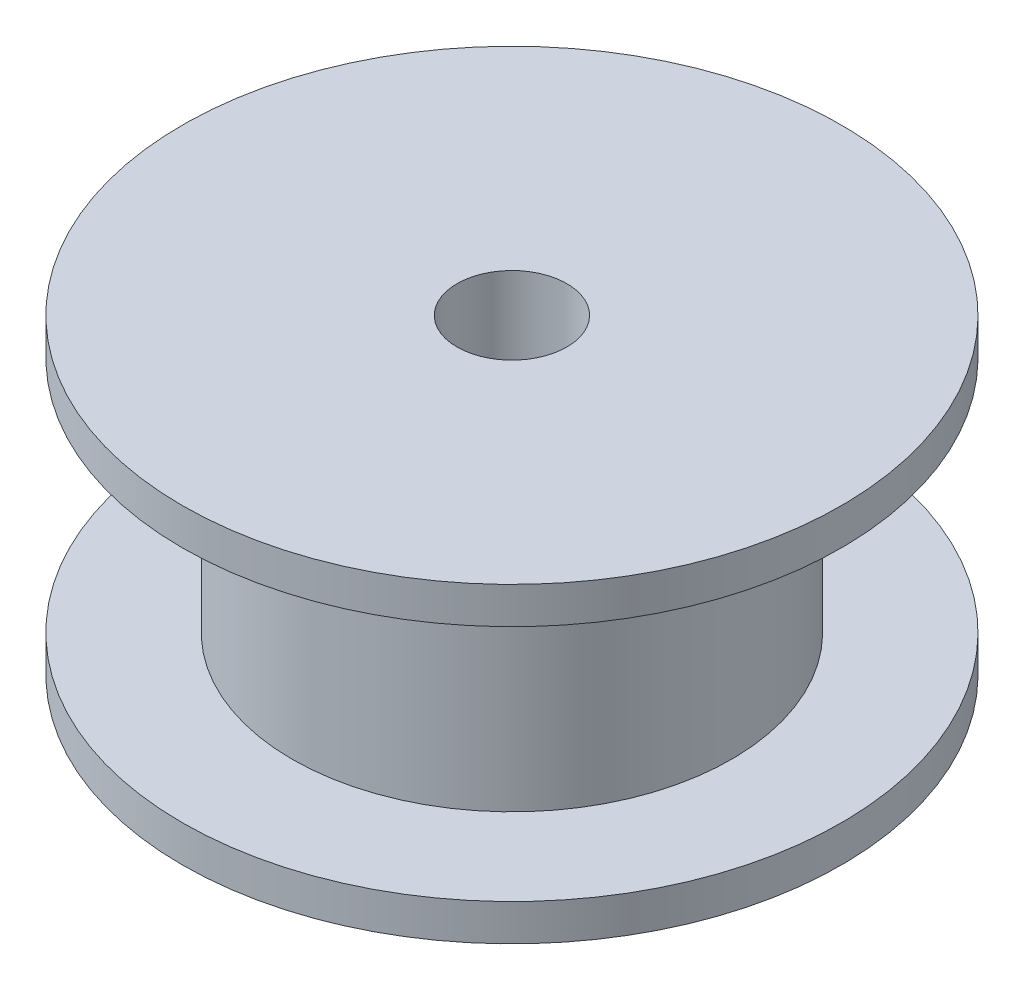
ISO-10303-21;
HEADER;
FILE_DESCRIPTION(('STEP AP214'),'2;1');
FILE_NAME('part.step','',(''),(''),'','','');
FILE_SCHEMA(('AUTOMOTIVE_DESIGN { 1 0 10303 214 1 1 1 1 }'));
ENDSEC;
DATA;
#1=APPLICATION_CONTEXT('core data for automotive mechanical design processes');
#2=APPLICATION_PROTOCOL_DEFINITION('international standard','automotive_design',2000,#1);
#3=PRODUCT_CONTEXT('',#1,'mechanical');
#4=PRODUCT('Part','Part','',(#3));
#5=PRODUCT_RELATED_PRODUCT_CATEGORY('part','',(#4));
#6=PRODUCT_DEFINITION_FORMATION('','',#4);
#7=PRODUCT_DEFINITION_CONTEXT('part definition',#1,'design');
#8=PRODUCT_DEFINITION('design','',#6,#7);
#9=PRODUCT_DEFINITION_SHAPE('','',#8);
#10=(LENGTH_UNIT() NAMED_UNIT(*) SI_UNIT(.MILLI.,.METRE.));
#11=(NAMED_UNIT(*) PLANE_ANGLE_UNIT() SI_UNIT($,.RADIAN.));
#12=(NAMED_UNIT(*) SI_UNIT($,.STERADIAN.) SOLID_ANGLE_UNIT());
#13=UNCERTAINTY_MEASURE_WITH_UNIT(LENGTH_MEASURE(1.E-05),#10,'distance_accuracy_value','');
#14=(GEOMETRIC_REPRESENTATION_CONTEXT(3) GLOBAL_UNCERTAINTY_ASSIGNED_CONTEXT((#13)) GLOBAL_UNIT_ASSIGNED_CONTEXT((#10,
#11,#12)) REPRESENTATION_CONTEXT('',''));
#15=CARTESIAN_POINT('',(0.,0.,0.));
#16=DIRECTION('',(0.,0.,1.));
#17=DIRECTION('',(1.,0.,0.));
#18=AXIS2_PLACEMENT_3D('',#15,#16,#17);
#19=CARTESIAN_POINT('',(0.,1.,0.));
#20=DIRECTION('',(0.,-1.,0.));
#21=DIRECTION('',(0.,0.,-1.));
#22=AXIS2_PLACEMENT_3D('',#19,#20,#21);
#23=CYLINDRICAL_SURFACE('',#22,9.);
#24=CARTESIAN_POINT('',(0.,1.,0.));
#25=DIRECTION('',(0.,1.,0.));
#26=DIRECTION('',(0.,0.,1.));
#27=AXIS2_PLACEMENT_3D('',#24,#25,#26);
#28=CIRCLE('',#27,9.);
#29=CARTESIAN_POINT('',(0.,1.,9.));
#30=VERTEX_POINT('',#29);
#31=EDGE_CURVE('E43',#30,#30,#28,.T.);
#32=ORIENTED_EDGE('',*,*,#31,.F.);
#33=EDGE_LOOP('',(#32));
#34=FACE_BOUND('',#33,.T.);
#35=CARTESIAN_POINT('',(0.,0.,0.));
#36=DIRECTION('',(0.,1.,0.));
#37=DIRECTION('',(0.,0.,1.));
#38=AXIS2_PLACEMENT_3D('',#35,#36,#37);
#39=CIRCLE('',#38,9.);
#40=CARTESIAN_POINT('',(0.,0.,9.));
#41=VERTEX_POINT('',#40);
#42=EDGE_CURVE('E39',#41,#41,#39,.T.);
#43=ORIENTED_EDGE('',*,*,#42,.T.);
#44=EDGE_LOOP('',(#43));
#45=FACE_BOUND('',#44,.T.);
#46=ADVANCED_FACE('F36',(#34,#45),#23,.T.);
#47=CARTESIAN_POINT('',(0.,1.,0.));
#48=DIRECTION('',(0.,1.,0.));
#49=DIRECTION('',(0.,0.,1.));
#50=AXIS2_PLACEMENT_3D('',#47,#48,#49);
#51=PLANE('',#50);
#52=CARTESIAN_POINT('',(0.,1.,0.));
#53=DIRECTION('',(0.,1.,0.));
#54=DIRECTION('',(0.,0.,1.));
#55=AXIS2_PLACEMENT_3D('',#52,#53,#54);
#56=CIRCLE('',#55,6.);
#57=CARTESIAN_POINT('',(0.,1.,6.));
#58=VERTEX_POINT('',#57);
#59=EDGE_CURVE('E10',#58,#58,#56,.T.);
#60=ORIENTED_EDGE('',*,*,#59,.F.);
#61=EDGE_LOOP('',(#60));
#62=FACE_BOUND('',#61,.T.);
#63=ORIENTED_EDGE('',*,*,#31,.T.);
#64=EDGE_LOOP('',(#63));
#65=FACE_BOUND('',#64,.T.);
#66=ADVANCED_FACE('F94',(#62,#65),#51,.T.);
#67=CARTESIAN_POINT('',(0.,0.,0.));
#68=DIRECTION('',(0.,1.,0.));
#69=DIRECTION('',(0.,0.,1.));
#70=AXIS2_PLACEMENT_3D('',#67,#68,#69);
#71=PLANE('',#70);
#72=CARTESIAN_POINT('',(0.,0.,0.));
#73=DIRECTION('',(0.,1.,0.));
#74=DIRECTION('',(0.,0.,1.));
#75=AXIS2_PLACEMENT_3D('',#72,#73,#74);
#76=CIRCLE('',#75,1.5);
#77=CARTESIAN_POINT('',(0.,0.,1.5));
#78=VERTEX_POINT('',#77);
#79=EDGE_CURVE('E56',#78,#78,#76,.T.);
#80=ORIENTED_EDGE('',*,*,#79,.T.);
#81=EDGE_LOOP('',(#80));
#82=FACE_BOUND('',#81,.T.);
#83=ORIENTED_EDGE('',*,*,#42,.F.);
#84=EDGE_LOOP('',(#83));
#85=FACE_BOUND('',#84,.T.);
#86=ADVANCED_FACE('F65',(#82,#85),#71,.F.);
#87=CARTESIAN_POINT('',(0.,7.5,0.));
#88=DIRECTION('',(0.,-1.,0.));
#89=DIRECTION('',(0.,0.,-1.));
#90=AXIS2_PLACEMENT_3D('',#87,#88,#89);
#91=CYLINDRICAL_SURFACE('',#90,6.);
#92=CARTESIAN_POINT('',(0.,7.5,0.));
#93=DIRECTION('',(0.,1.,0.));
#94=DIRECTION('',(0.,0.,1.));
#95=AXIS2_PLACEMENT_3D('',#92,#93,#94);
#96=CIRCLE('',#95,6.);
#97=CARTESIAN_POINT('',(0.,7.5,6.));
#98=VERTEX_POINT('',#97);
#99=EDGE_CURVE('E49',#98,#98,#96,.T.);
#100=ORIENTED_EDGE('',*,*,#99,.F.);
#101=EDGE_LOOP('',(#100));
#102=FACE_BOUND('',#101,.T.);
#103=ORIENTED_EDGE('',*,*,#59,.T.);
#104=EDGE_LOOP('',(#103));
#105=FACE_BOUND('',#104,.T.);
#106=ADVANCED_FACE('F84',(#102,#105),#91,.T.);
#107=CARTESIAN_POINT('',(0.,8.5,0.));
#108=DIRECTION('',(0.,-1.,0.));
#109=DIRECTION('',(0.,0.,-1.));
#110=AXIS2_PLACEMENT_3D('',#107,#108,#109);
#111=CYLINDRICAL_SURFACE('',#110,9.);
#112=CARTESIAN_POINT('',(0.,8.5,0.));
#113=DIRECTION('',(0.,1.,0.));
#114=DIRECTION('',(0.,0.,1.));
#115=AXIS2_PLACEMENT_3D('',#112,#113,#114);
#116=CIRCLE('',#115,9.);
#117=CARTESIAN_POINT('',(0.,8.5,9.));
#118=VERTEX_POINT('',#117);
#119=EDGE_CURVE('E52',#118,#118,#116,.T.);
#120=ORIENTED_EDGE('',*,*,#119,.F.);
#121=EDGE_LOOP('',(#120));
#122=FACE_BOUND('',#121,.T.);
#123=CARTESIAN_POINT('',(0.,7.5,0.));
#124=DIRECTION('',(0.,1.,0.));
#125=DIRECTION('',(0.,0.,1.));
#126=AXIS2_PLACEMENT_3D('',#123,#124,#125);
#127=CIRCLE('',#126,9.);
#128=CARTESIAN_POINT('',(0.,7.5,9.));
#129=VERTEX_POINT('',#128);
#130=EDGE_CURVE('E53',#129,#129,#127,.T.);
#131=ORIENTED_EDGE('',*,*,#130,.T.);
#132=EDGE_LOOP('',(#131));
#133=FACE_BOUND('',#132,.T.);
#134=ADVANCED_FACE('F78',(#122,#133),#111,.T.);
#135=CARTESIAN_POINT('',(0.,8.5,0.));
#136=DIRECTION('',(0.,1.,0.));
#137=DIRECTION('',(0.,0.,1.));
#138=AXIS2_PLACEMENT_3D('',#135,#136,#137);
#139=PLANE('',#138);
#140=CARTESIAN_POINT('',(0.,8.5,0.));
#141=DIRECTION('',(0.,1.,0.));
#142=DIRECTION('',(0.,0.,1.));
#143=AXIS2_PLACEMENT_3D('',#140,#141,#142);
#144=CIRCLE('',#143,1.5);
#145=CARTESIAN_POINT('',(0.,8.5,1.5));
#146=VERTEX_POINT('',#145);
#147=EDGE_CURVE('E59',#146,#146,#144,.T.);
#148=ORIENTED_EDGE('',*,*,#147,.F.);
#149=EDGE_LOOP('',(#148));
#150=FACE_BOUND('',#149,.T.);
#151=ORIENTED_EDGE('',*,*,#119,.T.);
#152=EDGE_LOOP('',(#151));
#153=FACE_BOUND('',#152,.T.);
#154=ADVANCED_FACE('F75',(#150,#153),#139,.T.);
#155=CARTESIAN_POINT('',(0.,7.5,0.));
#156=DIRECTION('',(0.,1.,0.));
#157=DIRECTION('',(0.,0.,1.));
#158=AXIS2_PLACEMENT_3D('',#155,#156,#157);
#159=PLANE('',#158);
#160=ORIENTED_EDGE('',*,*,#99,.T.);
#161=EDGE_LOOP('',(#160));
#162=FACE_BOUND('',#161,.T.);
#163=ORIENTED_EDGE('',*,*,#130,.F.);
#164=EDGE_LOOP('',(#163));
#165=FACE_BOUND('',#164,.T.);
#166=ADVANCED_FACE('F71',(#162,#165),#159,.F.);
#167=CARTESIAN_POINT('',(0.,0.,0.));
#168=DIRECTION('',(0.,1.,0.));
#169=DIRECTION('',(0.,0.,1.));
#170=AXIS2_PLACEMENT_3D('',#167,#168,#169);
#171=CYLINDRICAL_SURFACE('',#170,1.5);
#172=ORIENTED_EDGE('',*,*,#79,.F.);
#173=EDGE_LOOP('',(#172));
#174=FACE_BOUND('',#173,.T.);
#175=ORIENTED_EDGE('',*,*,#147,.T.);
#176=EDGE_LOOP('',(#175));
#177=FACE_BOUND('',#176,.T.);
#178=ADVANCED_FACE('F68',(#174,#177),#171,.F.);
#179=CLOSED_SHELL('',(#46,#66,#86,#106,#134,#154,#166,#178));
#180=MANIFOLD_SOLID_BREP('B2',#179);
#181=ADVANCED_BREP_SHAPE_REPRESENTATION('',(#18,#180),#14);
#182=SHAPE_DEFINITION_REPRESENTATION(#9,#181);
ENDSEC;
END-ISO-10303-21;
